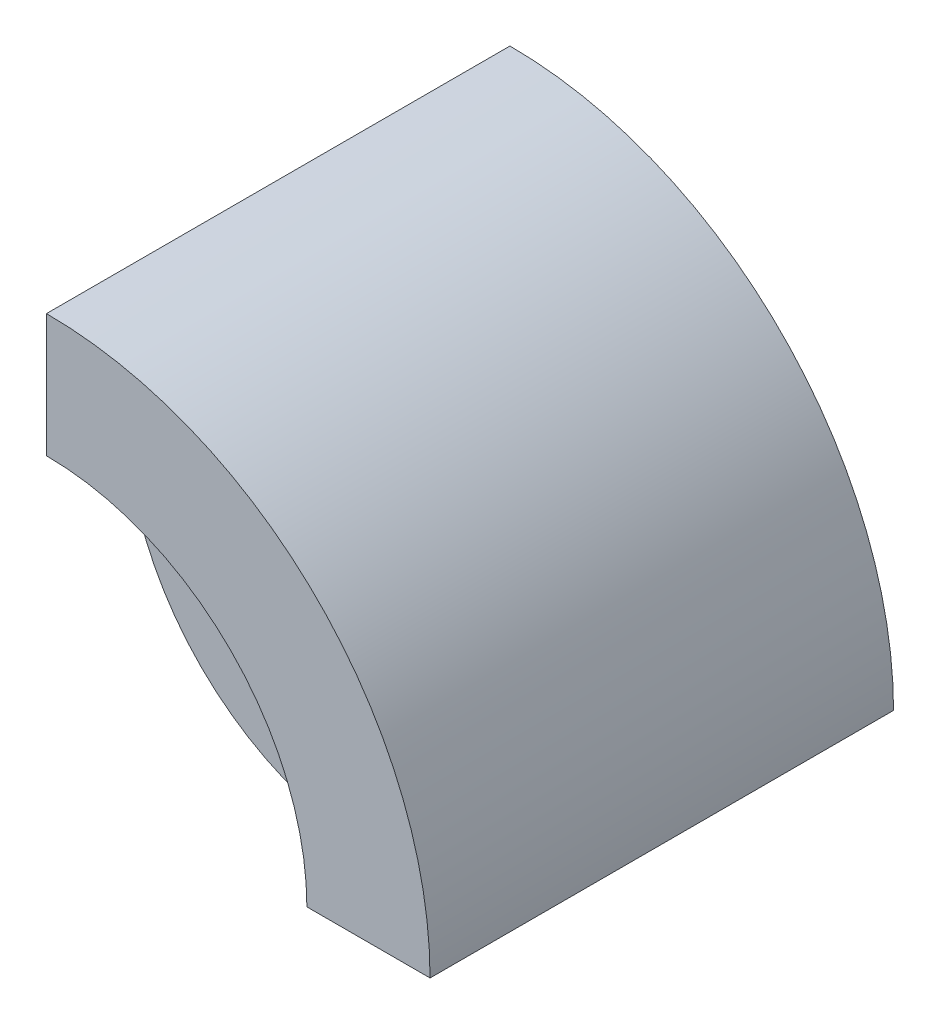
ISO-10303-21;
HEADER;
FILE_DESCRIPTION(('STEP AP214'),'2;1');
FILE_NAME('part.step','',(''),(''),'','','');
FILE_SCHEMA(('AUTOMOTIVE_DESIGN { 1 0 10303 214 1 1 1 1 }'));
ENDSEC;
DATA;
#1=APPLICATION_CONTEXT('core data for automotive mechanical design processes');
#2=APPLICATION_PROTOCOL_DEFINITION('international standard','automotive_design',2000,#1);
#3=PRODUCT_CONTEXT('',#1,'mechanical');
#4=PRODUCT('Part','Part','',(#3));
#5=PRODUCT_RELATED_PRODUCT_CATEGORY('part','',(#4));
#6=PRODUCT_DEFINITION_FORMATION('','',#4);
#7=PRODUCT_DEFINITION_CONTEXT('part definition',#1,'design');
#8=PRODUCT_DEFINITION('design','',#6,#7);
#9=PRODUCT_DEFINITION_SHAPE('','',#8);
#10=(LENGTH_UNIT() NAMED_UNIT(*) SI_UNIT(.MILLI.,.METRE.));
#11=(NAMED_UNIT(*) PLANE_ANGLE_UNIT() SI_UNIT($,.RADIAN.));
#12=(NAMED_UNIT(*) SI_UNIT($,.STERADIAN.) SOLID_ANGLE_UNIT());
#13=UNCERTAINTY_MEASURE_WITH_UNIT(LENGTH_MEASURE(1.E-05),#10,'distance_accuracy_value','');
#14=(GEOMETRIC_REPRESENTATION_CONTEXT(3) GLOBAL_UNCERTAINTY_ASSIGNED_CONTEXT((#13)) GLOBAL_UNIT_ASSIGNED_CONTEXT((#10,
#11,#12)) REPRESENTATION_CONTEXT('',''));
#15=CARTESIAN_POINT('',(0.,0.,0.));
#16=DIRECTION('',(0.,0.,1.));
#17=DIRECTION('',(1.,0.,0.));
#18=AXIS2_PLACEMENT_3D('',#15,#16,#17);
#19=CARTESIAN_POINT('',(0.,0.,9.525));
#20=DIRECTION('',(0.,0.,1.));
#21=DIRECTION('',(1.,0.,0.));
#22=AXIS2_PLACEMENT_3D('',#19,#20,#21);
#23=PLANE('',#22);
#24=CARTESIAN_POINT('',(0.,0.,9.525));
#25=DIRECTION('',(0.,0.,1.));
#26=DIRECTION('',(1.,0.,0.));
#27=AXIS2_PLACEMENT_3D('',#24,#25,#26);
#28=CIRCLE('',#27,11.1);
#29=CARTESIAN_POINT('',(-11.1,0.,9.525));
#30=VERTEX_POINT('',#29);
#31=EDGE_CURVE('E98',#30,#30,#28,.T.);
#32=ORIENTED_EDGE('',*,*,#31,.F.);
#33=EDGE_LOOP('',(#32));
#34=FACE_BOUND('',#33,.T.);
#35=DIRECTION('',(-1.,0.,0.));
#36=VECTOR('',#35,1.);
#37=CARTESIAN_POINT('',(0.,0.,9.525));
#38=LINE('',#37,#36);
#39=CARTESIAN_POINT('',(19.4,0.,9.525));
#40=VERTEX_POINT('',#39);
#41=CARTESIAN_POINT('',(19.0513784319709,0.,9.525));
#42=VERTEX_POINT('',#41);
#43=EDGE_CURVE('E127',#40,#42,#38,.T.);
#44=ORIENTED_EDGE('',*,*,#43,.F.);
#45=CARTESIAN_POINT('',(0.,0.,9.525));
#46=DIRECTION('',(0.,0.,1.));
#47=DIRECTION('',(1.,0.,0.));
#48=AXIS2_PLACEMENT_3D('',#45,#46,#47);
#49=CIRCLE('',#48,19.4);
#50=CARTESIAN_POINT('',(0.,19.4,9.525));
#51=VERTEX_POINT('',#50);
#52=EDGE_CURVE('E249',#40,#51,#49,.T.);
#53=ORIENTED_EDGE('',*,*,#52,.T.);
#54=DIRECTION('',(0.,-1.,0.));
#55=VECTOR('',#54,1.);
#56=CARTESIAN_POINT('',(0.,0.,9.525));
#57=LINE('',#56,#55);
#58=CARTESIAN_POINT('',(0.,19.0513784319709,9.525));
#59=VERTEX_POINT('',#58);
#60=EDGE_CURVE('E59',#51,#59,#57,.T.);
#61=ORIENTED_EDGE('',*,*,#60,.T.);
#62=CARTESIAN_POINT('',(0.,0.,9.525));
#63=DIRECTION('',(0.,0.,1.));
#64=DIRECTION('',(1.,0.,0.));
#65=AXIS2_PLACEMENT_3D('',#62,#63,#64);
#66=CIRCLE('',#65,19.0513784319709);
#67=EDGE_CURVE('E97',#59,#42,#66,.T.);
#68=ORIENTED_EDGE('',*,*,#67,.T.);
#69=EDGE_LOOP('',(#44,#53,#61,#68));
#70=FACE_BOUND('',#69,.T.);
#71=ADVANCED_FACE('F36',(#34,#70),#23,.T.);
#72=CARTESIAN_POINT('',(0.,0.,9.525));
#73=DIRECTION('',(0.,0.,-1.));
#74=DIRECTION('',(-1.,0.,0.));
#75=AXIS2_PLACEMENT_3D('',#72,#73,#74);
#76=CYLINDRICAL_SURFACE('',#75,19.0513784319709);
#77=CARTESIAN_POINT('',(0.,0.,0.));
#78=DIRECTION('',(0.,0.,1.));
#79=DIRECTION('',(1.,0.,0.));
#80=AXIS2_PLACEMENT_3D('',#77,#78,#79);
#81=CIRCLE('',#80,19.0513784319709);
#82=CARTESIAN_POINT('',(0.,19.0513784319709,0.));
#83=VERTEX_POINT('',#82);
#84=CARTESIAN_POINT('',(19.0513784319709,0.,0.));
#85=VERTEX_POINT('',#84);
#86=EDGE_CURVE('E95',#83,#85,#81,.T.);
#87=ORIENTED_EDGE('',*,*,#86,.T.);
#88=DIRECTION('',(0.,0.,-1.));
#89=VECTOR('',#88,1.);
#90=CARTESIAN_POINT('',(19.0513784319709,0.,9.525));
#91=LINE('',#90,#89);
#92=EDGE_CURVE('E11',#42,#85,#91,.T.);
#93=ORIENTED_EDGE('',*,*,#92,.F.);
#94=ORIENTED_EDGE('',*,*,#67,.F.);
#95=DIRECTION('',(0.,0.,-1.));
#96=VECTOR('',#95,1.);
#97=CARTESIAN_POINT('',(0.,19.0513784319709,9.525));
#98=LINE('',#97,#96);
#99=EDGE_CURVE('E81',#59,#83,#98,.T.);
#100=ORIENTED_EDGE('',*,*,#99,.T.);
#101=EDGE_LOOP('',(#87,#93,#94,#100));
#102=FACE_BOUND('',#101,.T.);
#103=ADVANCED_FACE('F38',(#102),#76,.T.);
#104=CARTESIAN_POINT('',(0.,0.,9.525));
#105=DIRECTION('',(0.,-1.,0.));
#106=DIRECTION('',(1.,0.,0.));
#107=AXIS2_PLACEMENT_3D('',#104,#105,#106);
#108=PLANE('',#107);
#109=DIRECTION('',(-1.,0.,0.));
#110=VECTOR('',#109,1.);
#111=CARTESIAN_POINT('',(0.,0.,0.));
#112=LINE('',#111,#110);
#113=CARTESIAN_POINT('',(28.575,0.,0.));
#114=VERTEX_POINT('',#113);
#115=EDGE_CURVE('E103',#114,#85,#112,.T.);
#116=ORIENTED_EDGE('',*,*,#115,.F.);
#117=DIRECTION('',(0.,0.,-1.));
#118=VECTOR('',#117,1.);
#119=CARTESIAN_POINT('',(28.575,0.,9.525));
#120=LINE('',#119,#118);
#121=CARTESIAN_POINT('',(28.575,0.,34.525));
#122=VERTEX_POINT('',#121);
#123=EDGE_CURVE('E44',#122,#114,#120,.T.);
#124=ORIENTED_EDGE('',*,*,#123,.F.);
#125=DIRECTION('',(1.,0.,0.));
#126=VECTOR('',#125,1.);
#127=CARTESIAN_POINT('',(0.,0.,34.525));
#128=LINE('',#127,#126);
#129=CARTESIAN_POINT('',(19.4,0.,34.525));
#130=VERTEX_POINT('',#129);
#131=EDGE_CURVE('E246',#130,#122,#128,.T.);
#132=ORIENTED_EDGE('',*,*,#131,.F.);
#133=DIRECTION('',(0.,0.,-1.));
#134=VECTOR('',#133,1.);
#135=CARTESIAN_POINT('',(19.4,0.,34.525));
#136=LINE('',#135,#134);
#137=EDGE_CURVE('E104',#130,#40,#136,.T.);
#138=ORIENTED_EDGE('',*,*,#137,.T.);
#139=ORIENTED_EDGE('',*,*,#43,.T.);
#140=ORIENTED_EDGE('',*,*,#92,.T.);
#141=EDGE_LOOP('',(#116,#124,#132,#138,#139,#140));
#142=FACE_BOUND('',#141,.T.);
#143=ADVANCED_FACE('F125',(#142),#108,.T.);
#144=CARTESIAN_POINT('',(0.,0.,9.525));
#145=DIRECTION('',(0.,0.,-1.));
#146=DIRECTION('',(-1.,0.,0.));
#147=AXIS2_PLACEMENT_3D('',#144,#145,#146);
#148=CYLINDRICAL_SURFACE('',#147,28.575);
#149=CARTESIAN_POINT('',(0.,0.,0.));
#150=DIRECTION('',(0.,0.,1.));
#151=DIRECTION('',(1.,0.,0.));
#152=AXIS2_PLACEMENT_3D('',#149,#150,#151);
#153=CIRCLE('',#152,28.575);
#154=CARTESIAN_POINT('',(0.,28.575,0.));
#155=VERTEX_POINT('',#154);
#156=EDGE_CURVE('E90',#114,#155,#153,.T.);
#157=ORIENTED_EDGE('',*,*,#156,.T.);
#158=DIRECTION('',(0.,0.,-1.));
#159=VECTOR('',#158,1.);
#160=CARTESIAN_POINT('',(0.,28.575,9.525));
#161=LINE('',#160,#159);
#162=CARTESIAN_POINT('',(0.,28.575,34.525));
#163=VERTEX_POINT('',#162);
#164=EDGE_CURVE('E85',#163,#155,#161,.T.);
#165=ORIENTED_EDGE('',*,*,#164,.F.);
#166=CARTESIAN_POINT('',(0.,0.,34.525));
#167=DIRECTION('',(0.,0.,1.));
#168=DIRECTION('',(1.,0.,0.));
#169=AXIS2_PLACEMENT_3D('',#166,#167,#168);
#170=CIRCLE('',#169,28.575);
#171=EDGE_CURVE('E121',#122,#163,#170,.T.);
#172=ORIENTED_EDGE('',*,*,#171,.F.);
#173=ORIENTED_EDGE('',*,*,#123,.T.);
#174=EDGE_LOOP('',(#157,#165,#172,#173));
#175=FACE_BOUND('',#174,.T.);
#176=ADVANCED_FACE('F118',(#175),#148,.T.);
#177=CARTESIAN_POINT('',(0.,0.,9.525));
#178=DIRECTION('',(1.,0.,0.));
#179=DIRECTION('',(0.,0.,-1.));
#180=AXIS2_PLACEMENT_3D('',#177,#178,#179);
#181=PLANE('',#180);
#182=DIRECTION('',(0.,-1.,0.));
#183=VECTOR('',#182,1.);
#184=CARTESIAN_POINT('',(0.,0.,0.));
#185=LINE('',#184,#183);
#186=EDGE_CURVE('E78',#155,#83,#185,.T.);
#187=ORIENTED_EDGE('',*,*,#186,.T.);
#188=ORIENTED_EDGE('',*,*,#99,.F.);
#189=ORIENTED_EDGE('',*,*,#60,.F.);
#190=DIRECTION('',(0.,0.,-1.));
#191=VECTOR('',#190,1.);
#192=CARTESIAN_POINT('',(0.,19.4,34.525));
#193=LINE('',#192,#191);
#194=CARTESIAN_POINT('',(0.,19.4,34.525));
#195=VERTEX_POINT('',#194);
#196=EDGE_CURVE('E51',#195,#51,#193,.T.);
#197=ORIENTED_EDGE('',*,*,#196,.F.);
#198=DIRECTION('',(0.,-1.,0.));
#199=VECTOR('',#198,1.);
#200=CARTESIAN_POINT('',(0.,0.,34.525));
#201=LINE('',#200,#199);
#202=EDGE_CURVE('E247',#163,#195,#201,.T.);
#203=ORIENTED_EDGE('',*,*,#202,.F.);
#204=ORIENTED_EDGE('',*,*,#164,.T.);
#205=EDGE_LOOP('',(#187,#188,#189,#197,#203,#204));
#206=FACE_BOUND('',#205,.T.);
#207=ADVANCED_FACE('F80',(#206),#181,.F.);
#208=CARTESIAN_POINT('',(0.,0.,9.525));
#209=DIRECTION('',(0.,0.,-1.));
#210=DIRECTION('',(-1.,0.,0.));
#211=AXIS2_PLACEMENT_3D('',#208,#209,#210);
#212=CYLINDRICAL_SURFACE('',#211,11.1);
#213=CARTESIAN_POINT('',(0.,0.,0.));
#214=DIRECTION('',(0.,0.,1.));
#215=DIRECTION('',(1.,0.,0.));
#216=AXIS2_PLACEMENT_3D('',#213,#214,#215);
#217=CIRCLE('',#216,11.1);
#218=CARTESIAN_POINT('',(-11.1,0.,0.));
#219=VERTEX_POINT('',#218);
#220=EDGE_CURVE('E89',#219,#219,#217,.T.);
#221=CARTESIAN_POINT('',(-11.1,0.,9.525));
#222=CARTESIAN_POINT('',(-11.1,0.,9.42578125));
#223=CARTESIAN_POINT('',(-11.1,0.,9.3265625));
#224=CARTESIAN_POINT('',(-11.1,0.,9.128125));
#225=CARTESIAN_POINT('',(-11.1,0.,9.02890625));
#226=CARTESIAN_POINT('',(-11.1,0.,8.83046875));
#227=CARTESIAN_POINT('',(-11.1,0.,8.73125));
#228=CARTESIAN_POINT('',(-11.1,0.,8.5328125));
#229=CARTESIAN_POINT('',(-11.1,0.,8.43359375));
#230=CARTESIAN_POINT('',(-11.1,0.,8.23515625));
#231=CARTESIAN_POINT('',(-11.1,0.,8.1359375));
#232=CARTESIAN_POINT('',(-11.1,0.,7.9375));
#233=CARTESIAN_POINT('',(-11.1,0.,7.83828125));
#234=CARTESIAN_POINT('',(-11.1,0.,7.63984375));
#235=CARTESIAN_POINT('',(-11.1,0.,7.540625));
#236=CARTESIAN_POINT('',(-11.1,0.,7.3421875));
#237=CARTESIAN_POINT('',(-11.1,0.,7.24296875));
#238=CARTESIAN_POINT('',(-11.1,0.,7.04453125));
#239=CARTESIAN_POINT('',(-11.1,0.,6.9453125));
#240=CARTESIAN_POINT('',(-11.1,0.,6.746875));
#241=CARTESIAN_POINT('',(-11.1,0.,6.64765625));
#242=CARTESIAN_POINT('',(-11.1,0.,6.44921875));
#243=CARTESIAN_POINT('',(-11.1,0.,6.35));
#244=CARTESIAN_POINT('',(-11.1,0.,6.1515625));
#245=CARTESIAN_POINT('',(-11.1,0.,6.05234375));
#246=CARTESIAN_POINT('',(-11.1,0.,5.85390625));
#247=CARTESIAN_POINT('',(-11.1,0.,5.7546875));
#248=CARTESIAN_POINT('',(-11.1,0.,5.55625));
#249=CARTESIAN_POINT('',(-11.1,0.,5.45703125));
#250=CARTESIAN_POINT('',(-11.1,0.,5.25859375));
#251=CARTESIAN_POINT('',(-11.1,0.,5.159375));
#252=CARTESIAN_POINT('',(-11.1,0.,4.9609375));
#253=CARTESIAN_POINT('',(-11.1,0.,4.86171875));
#254=CARTESIAN_POINT('',(-11.1,0.,4.66328125));
#255=CARTESIAN_POINT('',(-11.1,0.,4.5640625));
#256=CARTESIAN_POINT('',(-11.1,0.,4.365625));
#257=CARTESIAN_POINT('',(-11.1,0.,4.26640625));
#258=CARTESIAN_POINT('',(-11.1,0.,4.06796875));
#259=CARTESIAN_POINT('',(-11.1,0.,3.96875));
#260=CARTESIAN_POINT('',(-11.1,0.,3.7703125));
#261=CARTESIAN_POINT('',(-11.1,0.,3.67109375));
#262=CARTESIAN_POINT('',(-11.1,0.,3.47265625));
#263=CARTESIAN_POINT('',(-11.1,0.,3.3734375));
#264=CARTESIAN_POINT('',(-11.1,0.,3.175));
#265=CARTESIAN_POINT('',(-11.1,0.,3.07578125));
#266=CARTESIAN_POINT('',(-11.1,0.,2.87734375));
#267=CARTESIAN_POINT('',(-11.1,0.,2.778125));
#268=CARTESIAN_POINT('',(-11.1,0.,2.5796875));
#269=CARTESIAN_POINT('',(-11.1,0.,2.48046875));
#270=CARTESIAN_POINT('',(-11.1,0.,2.28203125));
#271=CARTESIAN_POINT('',(-11.1,0.,2.1828125));
#272=CARTESIAN_POINT('',(-11.1,0.,1.984375));
#273=CARTESIAN_POINT('',(-11.1,0.,1.88515625));
#274=CARTESIAN_POINT('',(-11.1,0.,1.68671875));
#275=CARTESIAN_POINT('',(-11.1,0.,1.5875));
#276=CARTESIAN_POINT('',(-11.1,0.,1.3890625));
#277=CARTESIAN_POINT('',(-11.1,0.,1.28984375));
#278=CARTESIAN_POINT('',(-11.1,0.,1.09140625));
#279=CARTESIAN_POINT('',(-11.1,0.,0.992187500000001));
#280=CARTESIAN_POINT('',(-11.1,0.,0.793750000000001));
#281=CARTESIAN_POINT('',(-11.1,0.,0.69453125));
#282=CARTESIAN_POINT('',(-11.1,0.,0.49609375));
#283=CARTESIAN_POINT('',(-11.1,0.,0.396875));
#284=CARTESIAN_POINT('',(-11.1,0.,0.1984375));
#285=CARTESIAN_POINT('',(-11.1,0.,0.0992187500000001));
#286=CARTESIAN_POINT('',(-11.1,0.,0.));
#287=B_SPLINE_CURVE_WITH_KNOTS('',3,(#221,#222,#223,#224,#225,#226,#227,#228,#229,#230,#231,
#232,#233,#234,#235,#236,#237,#238,#239,#240,#241,#242,#243,#244,#245,#246,#247,#248,#249,#250,
#251,#252,#253,#254,#255,#256,#257,#258,#259,#260,#261,#262,#263,#264,#265,#266,#267,#268,#269,
#270,#271,#272,#273,#274,#275,#276,#277,#278,#279,#280,#281,#282,#283,#284,#285,#286),
.UNSPECIFIED.,.F.,.F.,(4,2,2,2,2,2,2,2,2,2,2,2,2,2,2,2,2,2,2,2,2,2,2,2,2,2,2,2,2,2,2,2,4),(0.,
0.29765625,0.5953125,0.892968750000001,1.190625,1.48828125,1.7859375,2.08359375,2.38125,
2.67890625,2.9765625,3.27421875,3.571875,3.86953125,4.1671875,4.46484375,4.7625,5.06015625,
5.3578125,5.65546875,5.953125,6.25078125,6.5484375,6.84609375,7.14375,7.44140625,7.7390625,
8.03671875,8.334375,8.63203125,8.9296875,9.22734375,9.525),.UNSPECIFIED.);
#288=EDGE_CURVE('BSEAM136',#30,#219,#287,.T.);
#289=ORIENTED_EDGE('',*,*,#31,.T.);
#290=ORIENTED_EDGE('',*,*,#220,.F.);
#291=ORIENTED_EDGE('',*,*,#288,.T.);
#292=ORIENTED_EDGE('',*,*,#288,.F.);
#293=EDGE_LOOP('',(#289,#291,#290,#292));
#294=FACE_BOUND('',#293,.T.);
#295=ADVANCED_FACE('F136',(#294),#212,.F.);
#296=CARTESIAN_POINT('',(0.,0.,0.));
#297=DIRECTION('',(0.,0.,1.));
#298=DIRECTION('',(1.,0.,0.));
#299=AXIS2_PLACEMENT_3D('',#296,#297,#298);
#300=PLANE('',#299);
#301=ORIENTED_EDGE('',*,*,#86,.F.);
#302=ORIENTED_EDGE('',*,*,#186,.F.);
#303=ORIENTED_EDGE('',*,*,#156,.F.);
#304=ORIENTED_EDGE('',*,*,#115,.T.);
#305=EDGE_LOOP('',(#301,#302,#303,#304));
#306=FACE_BOUND('',#305,.T.);
#307=ORIENTED_EDGE('',*,*,#220,.T.);
#308=EDGE_LOOP('',(#307));
#309=FACE_BOUND('',#308,.T.);
#310=ADVANCED_FACE('F100',(#306,#309),#300,.F.);
#311=CARTESIAN_POINT('',(0.,0.,34.525));
#312=DIRECTION('',(0.,0.,-1.));
#313=DIRECTION('',(-1.,0.,0.));
#314=AXIS2_PLACEMENT_3D('',#311,#312,#313);
#315=CYLINDRICAL_SURFACE('',#314,19.4);
#316=ORIENTED_EDGE('',*,*,#52,.F.);
#317=ORIENTED_EDGE('',*,*,#137,.F.);
#318=CARTESIAN_POINT('',(0.,0.,34.525));
#319=DIRECTION('',(0.,0.,1.));
#320=DIRECTION('',(1.,0.,0.));
#321=AXIS2_PLACEMENT_3D('',#318,#319,#320);
#322=CIRCLE('',#321,19.4);
#323=EDGE_CURVE('E245',#130,#195,#322,.T.);
#324=ORIENTED_EDGE('',*,*,#323,.T.);
#325=ORIENTED_EDGE('',*,*,#196,.T.);
#326=EDGE_LOOP('',(#316,#317,#324,#325));
#327=FACE_BOUND('',#326,.T.);
#328=ADVANCED_FACE('F146',(#327),#315,.F.);
#329=CARTESIAN_POINT('',(0.,0.,34.525));
#330=DIRECTION('',(0.,0.,1.));
#331=DIRECTION('',(1.,0.,0.));
#332=AXIS2_PLACEMENT_3D('',#329,#330,#331);
#333=PLANE('',#332);
#334=ORIENTED_EDGE('',*,*,#323,.F.);
#335=ORIENTED_EDGE('',*,*,#131,.T.);
#336=ORIENTED_EDGE('',*,*,#171,.T.);
#337=ORIENTED_EDGE('',*,*,#202,.T.);
#338=EDGE_LOOP('',(#334,#335,#336,#337));
#339=FACE_BOUND('',#338,.T.);
#340=ADVANCED_FACE('F182',(#339),#333,.T.);
#341=CLOSED_SHELL('',(#71,#103,#143,#176,#207,#295,#310,#328,#340));
#342=MANIFOLD_SOLID_BREP('B2',#341);
#343=ADVANCED_BREP_SHAPE_REPRESENTATION('',(#18,#342),#14);
#344=SHAPE_DEFINITION_REPRESENTATION(#9,#343);
ENDSEC;
END-ISO-10303-21;
